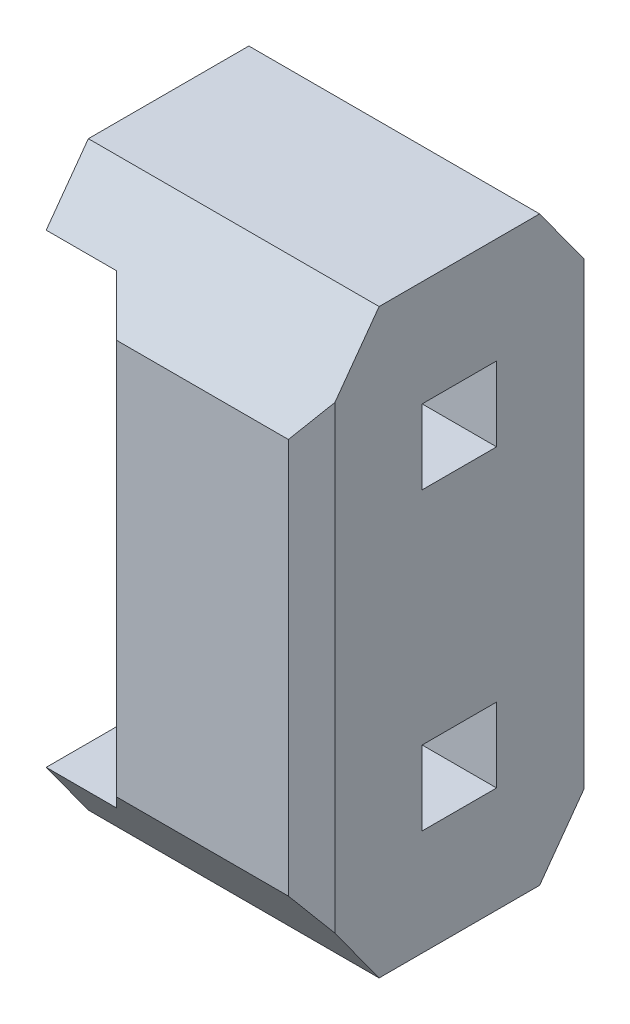
ISO-10303-21;
HEADER;
FILE_DESCRIPTION(('STEP AP214'),'2;1');
FILE_NAME('part.step','',(''),(''),'','','');
FILE_SCHEMA(('AUTOMOTIVE_DESIGN { 1 0 10303 214 1 1 1 1 }'));
ENDSEC;
DATA;
#1=APPLICATION_CONTEXT('core data for automotive mechanical design processes');
#2=APPLICATION_PROTOCOL_DEFINITION('international standard','automotive_design',2000,#1);
#3=PRODUCT_CONTEXT('',#1,'mechanical');
#4=PRODUCT('Part','Part','',(#3));
#5=PRODUCT_RELATED_PRODUCT_CATEGORY('part','',(#4));
#6=PRODUCT_DEFINITION_FORMATION('','',#4);
#7=PRODUCT_DEFINITION_CONTEXT('part definition',#1,'design');
#8=PRODUCT_DEFINITION('design','',#6,#7);
#9=PRODUCT_DEFINITION_SHAPE('','',#8);
#10=(LENGTH_UNIT() NAMED_UNIT(*) SI_UNIT(.MILLI.,.METRE.));
#11=(NAMED_UNIT(*) PLANE_ANGLE_UNIT() SI_UNIT($,.RADIAN.));
#12=(NAMED_UNIT(*) SI_UNIT($,.STERADIAN.) SOLID_ANGLE_UNIT());
#13=UNCERTAINTY_MEASURE_WITH_UNIT(LENGTH_MEASURE(1.E-05),#10,'distance_accuracy_value','');
#14=(GEOMETRIC_REPRESENTATION_CONTEXT(3) GLOBAL_UNCERTAINTY_ASSIGNED_CONTEXT((#13)) GLOBAL_UNIT_ASSIGNED_CONTEXT((#10,
#11,#12)) REPRESENTATION_CONTEXT('',''));
#15=CARTESIAN_POINT('',(0.,0.,0.));
#16=DIRECTION('',(0.,0.,1.));
#17=DIRECTION('',(1.,0.,0.));
#18=AXIS2_PLACEMENT_3D('',#15,#16,#17);
#19=CARTESIAN_POINT('',(1.25,4.6,-18.07));
#20=DIRECTION('',(0.,0.586967571460905,0.809610443394407));
#21=DIRECTION('',(0.,-0.809610443394407,0.586967571460905));
#22=AXIS2_PLACEMENT_3D('',#19,#20,#21);
#23=PLANE('',#22);
#24=DIRECTION('',(1.,0.,0.));
#25=VECTOR('',#24,1.);
#26=CARTESIAN_POINT('',(1.25,4.5,-17.9975));
#27=LINE('',#26,#25);
#28=CARTESIAN_POINT('',(0.,4.5,-17.9975));
#29=VERTEX_POINT('',#28);
#30=CARTESIAN_POINT('',(0.602500000000325,4.5,-17.9975000000001));
#31=VERTEX_POINT('',#30);
#32=EDGE_CURVE('E199',#29,#31,#27,.T.);
#33=ORIENTED_EDGE('',*,*,#32,.T.);
#34=DIRECTION('',(0.506207656348698,-0.698217457033983,0.506207656349602));
#35=VECTOR('',#34,1.);
#36=CARTESIAN_POINT('',(0.6025000000002,4.5,-17.9975));
#37=LINE('',#36,#35);
#38=CARTESIAN_POINT('',(0.819999999999671,4.2,-17.7799999999999));
#39=VERTEX_POINT('',#38);
#40=EDGE_CURVE('E197',#31,#39,#37,.T.);
#41=ORIENTED_EDGE('',*,*,#40,.T.);
#42=DIRECTION('',(1.,0.,0.));
#43=VECTOR('',#42,1.);
#44=CARTESIAN_POINT('',(1.25,4.19999999999999,-17.78));
#45=LINE('',#44,#43);
#46=CARTESIAN_POINT('',(2.30000000000012,4.2,-17.7799999999999));
#47=VERTEX_POINT('',#46);
#48=EDGE_CURVE('E20',#39,#47,#45,.T.);
#49=ORIENTED_EDGE('',*,*,#48,.T.);
#50=DIRECTION('',(0.506207656348961,0.698217457033859,-0.50620765634951));
#51=VECTOR('',#50,1.);
#52=CARTESIAN_POINT('',(2.3,4.19999999999999,-17.78));
#53=LINE('',#52,#51);
#54=CARTESIAN_POINT('',(2.49999999999988,4.47586206896591,-17.9800000000002));
#55=VERTEX_POINT('',#54);
#56=EDGE_CURVE('E181',#47,#55,#53,.T.);
#57=ORIENTED_EDGE('',*,*,#56,.T.);
#58=DIRECTION('',(0.,-0.809610443394407,0.586967571460905));
#59=VECTOR('',#58,1.);
#60=CARTESIAN_POINT('',(2.5,4.6,-18.07));
#61=LINE('',#60,#59);
#62=CARTESIAN_POINT('',(2.5,5.00000000000001,-18.36));
#63=VERTEX_POINT('',#62);
#64=EDGE_CURVE('E188',#55,#63,#61,.F.);
#65=ORIENTED_EDGE('',*,*,#64,.T.);
#66=DIRECTION('',(1.,0.,0.));
#67=VECTOR('',#66,1.);
#68=CARTESIAN_POINT('',(1.25,5.,-18.36));
#69=LINE('',#68,#67);
#70=CARTESIAN_POINT('',(0.,5.00000000000001,-18.36));
#71=VERTEX_POINT('',#70);
#72=EDGE_CURVE('E215',#71,#63,#69,.T.);
#73=ORIENTED_EDGE('',*,*,#72,.F.);
#74=DIRECTION('',(0.,-0.809610443394407,0.586967571460905));
#75=VECTOR('',#74,1.);
#76=CARTESIAN_POINT('',(0.,4.6,-18.07));
#77=LINE('',#76,#75);
#78=EDGE_CURVE('E207',#71,#29,#77,.T.);
#79=ORIENTED_EDGE('',*,*,#78,.T.);
#80=EDGE_LOOP('',(#33,#41,#49,#57,#65,#73,#79));
#81=FACE_BOUND('',#80,.T.);
#82=ADVANCED_FACE('F17',(#81),#23,.T.);
#83=CARTESIAN_POINT('',(1.25,4.6,-20.03));
#84=DIRECTION('',(0.,-0.586967571460905,0.809610443394407));
#85=DIRECTION('',(0.,-0.809610443394407,-0.586967571460905));
#86=AXIS2_PLACEMENT_3D('',#83,#84,#85);
#87=PLANE('',#86);
#88=DIRECTION('',(0.,-0.809610443394407,-0.586967571460905));
#89=VECTOR('',#88,1.);
#90=CARTESIAN_POINT('',(0.,4.6,-20.03));
#91=LINE('',#90,#89);
#92=CARTESIAN_POINT('',(0.,5.00000000000001,-19.74));
#93=VERTEX_POINT('',#92);
#94=CARTESIAN_POINT('',(0.,4.5,-20.1025));
#95=VERTEX_POINT('',#94);
#96=EDGE_CURVE('E263',#93,#95,#91,.T.);
#97=ORIENTED_EDGE('',*,*,#96,.F.);
#98=DIRECTION('',(1.,0.,0.));
#99=VECTOR('',#98,1.);
#100=CARTESIAN_POINT('',(1.25,5.,-19.74));
#101=LINE('',#100,#99);
#102=CARTESIAN_POINT('',(2.5,5.,-19.74));
#103=VERTEX_POINT('',#102);
#104=EDGE_CURVE('E227',#103,#93,#101,.F.);
#105=ORIENTED_EDGE('',*,*,#104,.F.);
#106=DIRECTION('',(0.,-0.809610443394407,-0.586967571460905));
#107=VECTOR('',#106,1.);
#108=CARTESIAN_POINT('',(2.5,4.6,-20.03));
#109=LINE('',#108,#107);
#110=CARTESIAN_POINT('',(2.49999999999988,4.47586206896591,-20.1199999999998));
#111=VERTEX_POINT('',#110);
#112=EDGE_CURVE('E223',#111,#103,#109,.F.);
#113=ORIENTED_EDGE('',*,*,#112,.F.);
#114=DIRECTION('',(0.506207656348961,0.698217457033859,0.50620765634951));
#115=VECTOR('',#114,1.);
#116=CARTESIAN_POINT('',(2.3,4.19999999999999,-20.32));
#117=LINE('',#116,#115);
#118=CARTESIAN_POINT('',(2.30000000000012,4.2,-20.3200000000001));
#119=VERTEX_POINT('',#118);
#120=EDGE_CURVE('E266',#119,#111,#117,.T.);
#121=ORIENTED_EDGE('',*,*,#120,.F.);
#122=DIRECTION('',(1.,0.,0.));
#123=VECTOR('',#122,1.);
#124=CARTESIAN_POINT('',(1.25,4.19999999999999,-20.32));
#125=LINE('',#124,#123);
#126=CARTESIAN_POINT('',(0.819999999999671,4.2,-20.3200000000001));
#127=VERTEX_POINT('',#126);
#128=EDGE_CURVE('E205',#127,#119,#125,.T.);
#129=ORIENTED_EDGE('',*,*,#128,.F.);
#130=DIRECTION('',(0.506207656348697,-0.698217457033984,-0.506207656349602));
#131=VECTOR('',#130,1.);
#132=CARTESIAN_POINT('',(0.6025000000002,4.5,-20.1025));
#133=LINE('',#132,#131);
#134=CARTESIAN_POINT('',(0.602500000000324,4.5,-20.1024999999999));
#135=VERTEX_POINT('',#134);
#136=EDGE_CURVE('E203',#135,#127,#133,.T.);
#137=ORIENTED_EDGE('',*,*,#136,.F.);
#138=DIRECTION('',(1.,0.,0.));
#139=VECTOR('',#138,1.);
#140=CARTESIAN_POINT('',(1.25,4.5,-20.1025));
#141=LINE('',#140,#139);
#142=EDGE_CURVE('E261',#95,#135,#141,.T.);
#143=ORIENTED_EDGE('',*,*,#142,.F.);
#144=EDGE_LOOP('',(#97,#105,#113,#121,#129,#137,#143));
#145=FACE_BOUND('',#144,.T.);
#146=ADVANCED_FACE('F285',(#145),#87,.F.);
#147=CARTESIAN_POINT('',(1.25,0.4,-20.03));
#148=DIRECTION('',(0.,0.586967571460905,0.809610443394407));
#149=DIRECTION('',(0.,-0.809610443394407,0.586967571460905));
#150=AXIS2_PLACEMENT_3D('',#147,#148,#149);
#151=PLANE('',#150);
#152=DIRECTION('',(-0.506207656349401,0.698217457033646,-0.506207656349363));
#153=VECTOR('',#152,1.);
#154=CARTESIAN_POINT('',(2.5,0.524137931034496,-20.12));
#155=LINE('',#154,#153);
#156=CARTESIAN_POINT('',(2.49999999999988,0.524137931034498,-20.1199999999999));
#157=VERTEX_POINT('',#156);
#158=CARTESIAN_POINT('',(2.30000000000012,0.800000000000005,-20.3200000000001));
#159=VERTEX_POINT('',#158);
#160=EDGE_CURVE('E251',#157,#159,#155,.T.);
#161=ORIENTED_EDGE('',*,*,#160,.F.);
#162=DIRECTION('',(0.,-0.809610443394407,0.586967571460905));
#163=VECTOR('',#162,1.);
#164=CARTESIAN_POINT('',(2.5,0.4,-20.03));
#165=LINE('',#164,#163);
#166=CARTESIAN_POINT('',(2.5,0.,-19.74));
#167=VERTEX_POINT('',#166);
#168=EDGE_CURVE('E253',#167,#157,#165,.F.);
#169=ORIENTED_EDGE('',*,*,#168,.F.);
#170=DIRECTION('',(1.,0.,0.));
#171=VECTOR('',#170,1.);
#172=CARTESIAN_POINT('',(1.25,0.,-19.74));
#173=LINE('',#172,#171);
#174=CARTESIAN_POINT('',(0.,0.,-19.74));
#175=VERTEX_POINT('',#174);
#176=EDGE_CURVE('E288',#167,#175,#173,.F.);
#177=ORIENTED_EDGE('',*,*,#176,.T.);
#178=DIRECTION('',(0.,-0.809610443394407,0.586967571460905));
#179=VECTOR('',#178,1.);
#180=CARTESIAN_POINT('',(0.,0.4,-20.03));
#181=LINE('',#180,#179);
#182=CARTESIAN_POINT('',(0.,0.5,-20.1025));
#183=VERTEX_POINT('',#182);
#184=EDGE_CURVE('E255',#183,#175,#181,.T.);
#185=ORIENTED_EDGE('',*,*,#184,.F.);
#186=DIRECTION('',(1.,0.,0.));
#187=VECTOR('',#186,1.);
#188=CARTESIAN_POINT('',(1.25,0.500000000000001,-20.1025));
#189=LINE('',#188,#187);
#190=CARTESIAN_POINT('',(0.602500000000324,0.5,-20.1024999999999));
#191=VERTEX_POINT('',#190);
#192=EDGE_CURVE('E257',#191,#183,#189,.F.);
#193=ORIENTED_EDGE('',*,*,#192,.F.);
#194=DIRECTION('',(-0.506207656348693,-0.698217457033984,0.506207656349605));
#195=VECTOR('',#194,1.);
#196=CARTESIAN_POINT('',(0.8199999999998,0.80000000000001,-20.32));
#197=LINE('',#196,#195);
#198=CARTESIAN_POINT('',(0.819999999999671,0.800000000000005,-20.3200000000001));
#199=VERTEX_POINT('',#198);
#200=EDGE_CURVE('E259',#199,#191,#197,.T.);
#201=ORIENTED_EDGE('',*,*,#200,.F.);
#202=DIRECTION('',(1.,0.,0.));
#203=VECTOR('',#202,1.);
#204=CARTESIAN_POINT('',(1.25,0.80000000000001,-20.32));
#205=LINE('',#204,#203);
#206=EDGE_CURVE('E249',#159,#199,#205,.F.);
#207=ORIENTED_EDGE('',*,*,#206,.F.);
#208=EDGE_LOOP('',(#161,#169,#177,#185,#193,#201,#207));
#209=FACE_BOUND('',#208,.T.);
#210=ADVANCED_FACE('F431',(#209),#151,.F.);
#211=CARTESIAN_POINT('',(1.25,0.4,-18.07));
#212=DIRECTION('',(0.,-0.586967571460905,0.809610443394407));
#213=DIRECTION('',(0.,-0.809610443394407,-0.586967571460905));
#214=AXIS2_PLACEMENT_3D('',#211,#212,#213);
#215=PLANE('',#214);
#216=DIRECTION('',(1.,0.,0.));
#217=VECTOR('',#216,1.);
#218=CARTESIAN_POINT('',(1.25,0.80000000000001,-17.78));
#219=LINE('',#218,#217);
#220=CARTESIAN_POINT('',(2.30000000000012,0.800000000000005,-17.7799999999999));
#221=VERTEX_POINT('',#220);
#222=CARTESIAN_POINT('',(0.819999999999671,0.800000000000005,-17.7799999999999));
#223=VERTEX_POINT('',#222);
#224=EDGE_CURVE('E191',#221,#223,#219,.F.);
#225=ORIENTED_EDGE('',*,*,#224,.T.);
#226=DIRECTION('',(-0.506207656348694,-0.698217457033983,-0.506207656349606));
#227=VECTOR('',#226,1.);
#228=CARTESIAN_POINT('',(0.8199999999998,0.80000000000001,-17.78));
#229=LINE('',#228,#227);
#230=CARTESIAN_POINT('',(0.602500000000325,0.500000000000001,-17.9975000000001));
#231=VERTEX_POINT('',#230);
#232=EDGE_CURVE('E232',#223,#231,#229,.T.);
#233=ORIENTED_EDGE('',*,*,#232,.T.);
#234=DIRECTION('',(1.,0.,0.));
#235=VECTOR('',#234,1.);
#236=CARTESIAN_POINT('',(1.25,0.500000000000002,-17.9975));
#237=LINE('',#236,#235);
#238=CARTESIAN_POINT('',(0.,0.500000000000001,-17.9975));
#239=VERTEX_POINT('',#238);
#240=EDGE_CURVE('E246',#231,#239,#237,.F.);
#241=ORIENTED_EDGE('',*,*,#240,.T.);
#242=DIRECTION('',(0.,-0.809610443394407,-0.586967571460905));
#243=VECTOR('',#242,1.);
#244=CARTESIAN_POINT('',(0.,0.4,-18.07));
#245=LINE('',#244,#243);
#246=CARTESIAN_POINT('',(0.,0.,-18.36));
#247=VERTEX_POINT('',#246);
#248=EDGE_CURVE('E244',#239,#247,#245,.T.);
#249=ORIENTED_EDGE('',*,*,#248,.T.);
#250=DIRECTION('',(1.,0.,0.));
#251=VECTOR('',#250,1.);
#252=CARTESIAN_POINT('',(1.25,0.,-18.36));
#253=LINE('',#252,#251);
#254=CARTESIAN_POINT('',(2.5,0.,-18.36));
#255=VERTEX_POINT('',#254);
#256=EDGE_CURVE('E293',#247,#255,#253,.T.);
#257=ORIENTED_EDGE('',*,*,#256,.T.);
#258=DIRECTION('',(0.,-0.809610443394407,-0.586967571460905));
#259=VECTOR('',#258,1.);
#260=CARTESIAN_POINT('',(2.5,0.4,-18.07));
#261=LINE('',#260,#259);
#262=CARTESIAN_POINT('',(2.49999999999988,0.524137931034498,-17.9800000000001));
#263=VERTEX_POINT('',#262);
#264=EDGE_CURVE('E241',#255,#263,#261,.F.);
#265=ORIENTED_EDGE('',*,*,#264,.T.);
#266=DIRECTION('',(-0.506207656349401,0.698217457033646,0.506207656349363));
#267=VECTOR('',#266,1.);
#268=CARTESIAN_POINT('',(2.5,0.524137931034496,-17.98));
#269=LINE('',#268,#267);
#270=EDGE_CURVE('E239',#263,#221,#269,.T.);
#271=ORIENTED_EDGE('',*,*,#270,.T.);
#272=EDGE_LOOP('',(#225,#233,#241,#249,#257,#265,#271));
#273=FACE_BOUND('',#272,.T.);
#274=ADVANCED_FACE('F421',(#273),#215,.T.);
#275=CARTESIAN_POINT('',(1.25,5.,-19.05));
#276=DIRECTION('',(0.,1.,0.));
#277=DIRECTION('',(0.,0.,1.));
#278=AXIS2_PLACEMENT_3D('',#275,#276,#277);
#279=PLANE('',#278);
#280=ORIENTED_EDGE('',*,*,#104,.T.);
#281=DIRECTION('',(0.,0.,-1.));
#282=VECTOR('',#281,1.);
#283=CARTESIAN_POINT('',(0.,5.,-19.05));
#284=LINE('',#283,#282);
#285=EDGE_CURVE('E231',#93,#71,#284,.F.);
#286=ORIENTED_EDGE('',*,*,#285,.T.);
#287=ORIENTED_EDGE('',*,*,#72,.T.);
#288=DIRECTION('',(0.,0.,1.));
#289=VECTOR('',#288,1.);
#290=CARTESIAN_POINT('',(2.5,5.,-19.05));
#291=LINE('',#290,#289);
#292=EDGE_CURVE('E219',#63,#103,#291,.F.);
#293=ORIENTED_EDGE('',*,*,#292,.T.);
#294=EDGE_LOOP('',(#280,#286,#287,#293));
#295=FACE_BOUND('',#294,.T.);
#296=ADVANCED_FACE('F229',(#295),#279,.T.);
#297=CARTESIAN_POINT('',(1.25,0.,-19.05));
#298=DIRECTION('',(0.,1.,0.));
#299=DIRECTION('',(0.,0.,1.));
#300=AXIS2_PLACEMENT_3D('',#297,#298,#299);
#301=PLANE('',#300);
#302=DIRECTION('',(0.,0.,-1.));
#303=VECTOR('',#302,1.);
#304=CARTESIAN_POINT('',(0.,0.,-19.05));
#305=LINE('',#304,#303);
#306=EDGE_CURVE('E297',#247,#175,#305,.T.);
#307=ORIENTED_EDGE('',*,*,#306,.T.);
#308=ORIENTED_EDGE('',*,*,#176,.F.);
#309=DIRECTION('',(0.,0.,1.));
#310=VECTOR('',#309,1.);
#311=CARTESIAN_POINT('',(2.5,0.,-19.05));
#312=LINE('',#311,#310);
#313=EDGE_CURVE('E287',#255,#167,#312,.F.);
#314=ORIENTED_EDGE('',*,*,#313,.F.);
#315=ORIENTED_EDGE('',*,*,#256,.F.);
#316=EDGE_LOOP('',(#307,#308,#314,#315));
#317=FACE_BOUND('',#316,.T.);
#318=ADVANCED_FACE('F428',(#317),#301,.F.);
#319=CARTESIAN_POINT('',(0.,4.75,-19.05));
#320=DIRECTION('',(1.,0.,0.));
#321=DIRECTION('',(0.,0.,-1.));
#322=AXIS2_PLACEMENT_3D('',#319,#320,#321);
#323=PLANE('',#322);
#324=ORIENTED_EDGE('',*,*,#285,.F.);
#325=ORIENTED_EDGE('',*,*,#96,.T.);
#326=DIRECTION('',(0.,0.,1.));
#327=VECTOR('',#326,1.);
#328=CARTESIAN_POINT('',(0.,4.5,-19.05));
#329=LINE('',#328,#327);
#330=EDGE_CURVE('E307',#95,#29,#329,.T.);
#331=ORIENTED_EDGE('',*,*,#330,.T.);
#332=ORIENTED_EDGE('',*,*,#78,.F.);
#333=EDGE_LOOP('',(#324,#325,#331,#332));
#334=FACE_BOUND('',#333,.T.);
#335=ADVANCED_FACE('F441',(#334),#323,.F.);
#336=CARTESIAN_POINT('',(0.,0.25,-19.05));
#337=DIRECTION('',(1.,0.,0.));
#338=DIRECTION('',(0.,0.,-1.));
#339=AXIS2_PLACEMENT_3D('',#336,#337,#338);
#340=PLANE('',#339);
#341=ORIENTED_EDGE('',*,*,#306,.F.);
#342=ORIENTED_EDGE('',*,*,#248,.F.);
#343=DIRECTION('',(0.,0.,1.));
#344=VECTOR('',#343,1.);
#345=CARTESIAN_POINT('',(0.,0.5,-19.05));
#346=LINE('',#345,#344);
#347=EDGE_CURVE('E315',#183,#239,#346,.T.);
#348=ORIENTED_EDGE('',*,*,#347,.F.);
#349=ORIENTED_EDGE('',*,*,#184,.T.);
#350=EDGE_LOOP('',(#341,#342,#348,#349));
#351=FACE_BOUND('',#350,.T.);
#352=ADVANCED_FACE('F443',(#351),#340,.F.);
#353=CARTESIAN_POINT('',(1.55,3.45,-19.05));
#354=DIRECTION('',(0.,1.,0.));
#355=DIRECTION('',(0.,0.,1.));
#356=AXIS2_PLACEMENT_3D('',#353,#354,#355);
#357=PLANE('',#356);
#358=DIRECTION('',(1.,0.,0.));
#359=VECTOR('',#358,1.);
#360=CARTESIAN_POINT('',(1.55,3.45,-19.37));
#361=LINE('',#360,#359);
#362=CARTESIAN_POINT('',(0.6,3.45,-19.37));
#363=VERTEX_POINT('',#362);
#364=CARTESIAN_POINT('',(2.5,3.45,-19.37));
#365=VERTEX_POINT('',#364);
#366=EDGE_CURVE('E332',#363,#365,#361,.T.);
#367=ORIENTED_EDGE('',*,*,#366,.F.);
#368=DIRECTION('',(0.,0.,1.));
#369=VECTOR('',#368,1.);
#370=CARTESIAN_POINT('',(0.6,3.45,-19.05));
#371=LINE('',#370,#369);
#372=CARTESIAN_POINT('',(0.6,3.45,-18.73));
#373=VERTEX_POINT('',#372);
#374=EDGE_CURVE('E302',#363,#373,#371,.T.);
#375=ORIENTED_EDGE('',*,*,#374,.T.);
#376=DIRECTION('',(1.,0.,0.));
#377=VECTOR('',#376,1.);
#378=CARTESIAN_POINT('',(1.55,3.45,-18.73));
#379=LINE('',#378,#377);
#380=CARTESIAN_POINT('',(2.5,3.45,-18.73));
#381=VERTEX_POINT('',#380);
#382=EDGE_CURVE('E327',#373,#381,#379,.T.);
#383=ORIENTED_EDGE('',*,*,#382,.T.);
#384=DIRECTION('',(0.,0.,1.));
#385=VECTOR('',#384,1.);
#386=CARTESIAN_POINT('',(2.5,3.45,-19.05));
#387=LINE('',#386,#385);
#388=EDGE_CURVE('E300',#381,#365,#387,.F.);
#389=ORIENTED_EDGE('',*,*,#388,.T.);
#390=EDGE_LOOP('',(#367,#375,#383,#389));
#391=FACE_BOUND('',#390,.T.);
#392=ADVANCED_FACE('F398',(#391),#357,.T.);
#393=CARTESIAN_POINT('',(0.71,2.5,-20.21));
#394=DIRECTION('',(0.707106781190498,0.,0.707106781182598));
#395=DIRECTION('',(0.707106781182598,0.,-0.707106781190498));
#396=AXIS2_PLACEMENT_3D('',#393,#394,#395);
#397=PLANE('',#396);
#398=ORIENTED_EDGE('',*,*,#200,.T.);
#399=DIRECTION('',(0.707106781187161,0.,-0.707106781185934));
#400=VECTOR('',#399,1.);
#401=CARTESIAN_POINT('',(0.6000000000002,0.5,-20.1));
#402=LINE('',#401,#400);
#403=CARTESIAN_POINT('',(0.600000000000408,0.5,-20.0999999999997));
#404=VERTEX_POINT('',#403);
#405=EDGE_CURVE('E312',#404,#191,#402,.T.);
#406=ORIENTED_EDGE('',*,*,#405,.F.);
#407=DIRECTION('',(0.,1.,0.));
#408=VECTOR('',#407,1.);
#409=CARTESIAN_POINT('',(0.6,2.5,-20.1));
#410=LINE('',#409,#408);
#411=CARTESIAN_POINT('',(0.600000000000408,4.5,-20.0999999999997));
#412=VERTEX_POINT('',#411);
#413=EDGE_CURVE('E337',#404,#412,#410,.T.);
#414=ORIENTED_EDGE('',*,*,#413,.T.);
#415=DIRECTION('',(0.707106781187161,0.,-0.707106781185934));
#416=VECTOR('',#415,1.);
#417=CARTESIAN_POINT('',(0.6000000000002,4.5,-20.1));
#418=LINE('',#417,#416);
#419=EDGE_CURVE('E304',#412,#135,#418,.T.);
#420=ORIENTED_EDGE('',*,*,#419,.T.);
#421=ORIENTED_EDGE('',*,*,#136,.T.);
#422=DIRECTION('',(0.,1.,0.));
#423=VECTOR('',#422,1.);
#424=CARTESIAN_POINT('',(0.8199999999998,2.5,-20.32));
#425=LINE('',#424,#423);
#426=EDGE_CURVE('E275',#127,#199,#425,.F.);
#427=ORIENTED_EDGE('',*,*,#426,.T.);
#428=EDGE_LOOP('',(#398,#406,#414,#420,#421,#427));
#429=FACE_BOUND('',#428,.T.);
#430=ADVANCED_FACE('F435',(#429),#397,.F.);
#431=CARTESIAN_POINT('',(0.30125,4.5,-19.05));
#432=DIRECTION('',(0.,1.,0.));
#433=DIRECTION('',(0.,0.,1.));
#434=AXIS2_PLACEMENT_3D('',#431,#432,#433);
#435=PLANE('',#434);
#436=ORIENTED_EDGE('',*,*,#142,.T.);
#437=ORIENTED_EDGE('',*,*,#419,.F.);
#438=DIRECTION('',(0.,0.,-1.));
#439=VECTOR('',#438,1.);
#440=CARTESIAN_POINT('',(0.6,4.5,-19.05));
#441=LINE('',#440,#439);
#442=CARTESIAN_POINT('',(0.600000000000278,4.5,-18.0000000000001));
#443=VERTEX_POINT('',#442);
#444=EDGE_CURVE('E339',#412,#443,#441,.F.);
#445=ORIENTED_EDGE('',*,*,#444,.T.);
#446=DIRECTION('',(-0.707106781182598,0.,-0.707106781190498));
#447=VECTOR('',#446,1.);
#448=CARTESIAN_POINT('',(0.71,4.5,-17.89));
#449=LINE('',#448,#447);
#450=EDGE_CURVE('E310',#443,#31,#449,.F.);
#451=ORIENTED_EDGE('',*,*,#450,.T.);
#452=ORIENTED_EDGE('',*,*,#32,.F.);
#453=ORIENTED_EDGE('',*,*,#330,.F.);
#454=EDGE_LOOP('',(#436,#437,#445,#451,#452,#453));
#455=FACE_BOUND('',#454,.T.);
#456=ADVANCED_FACE('F439',(#455),#435,.F.);
#457=CARTESIAN_POINT('',(0.71,2.5,-17.89));
#458=DIRECTION('',(0.707106781190498,0.,-0.707106781182598));
#459=DIRECTION('',(-0.707106781182598,0.,-0.707106781190498));
#460=AXIS2_PLACEMENT_3D('',#457,#458,#459);
#461=PLANE('',#460);
#462=ORIENTED_EDGE('',*,*,#232,.F.);
#463=DIRECTION('',(0.,1.,0.));
#464=VECTOR('',#463,1.);
#465=CARTESIAN_POINT('',(0.8199999999998,2.5,-17.78));
#466=LINE('',#465,#464);
#467=EDGE_CURVE('E325',#39,#223,#466,.F.);
#468=ORIENTED_EDGE('',*,*,#467,.F.);
#469=ORIENTED_EDGE('',*,*,#40,.F.);
#470=ORIENTED_EDGE('',*,*,#450,.F.);
#471=DIRECTION('',(0.,1.,0.));
#472=VECTOR('',#471,1.);
#473=CARTESIAN_POINT('',(0.6,2.5,-18.));
#474=LINE('',#473,#472);
#475=CARTESIAN_POINT('',(0.600000000000407,0.5,-18.0000000000003));
#476=VERTEX_POINT('',#475);
#477=EDGE_CURVE('E341',#443,#476,#474,.F.);
#478=ORIENTED_EDGE('',*,*,#477,.T.);
#479=DIRECTION('',(-0.70710678118618,0.,-0.707106781186916));
#480=VECTOR('',#479,1.);
#481=CARTESIAN_POINT('',(0.6025000000002,0.5,-17.9975));
#482=LINE('',#481,#480);
#483=EDGE_CURVE('E318',#231,#476,#482,.T.);
#484=ORIENTED_EDGE('',*,*,#483,.F.);
#485=EDGE_LOOP('',(#462,#468,#469,#470,#478,#484));
#486=FACE_BOUND('',#485,.T.);
#487=ADVANCED_FACE('F416',(#486),#461,.F.);
#488=CARTESIAN_POINT('',(0.30125,0.5,-19.05));
#489=DIRECTION('',(0.,1.,0.));
#490=DIRECTION('',(0.,0.,1.));
#491=AXIS2_PLACEMENT_3D('',#488,#489,#490);
#492=PLANE('',#491);
#493=ORIENTED_EDGE('',*,*,#483,.T.);
#494=DIRECTION('',(0.,0.,-1.));
#495=VECTOR('',#494,1.);
#496=CARTESIAN_POINT('',(0.6,0.5,-19.05));
#497=LINE('',#496,#495);
#498=EDGE_CURVE('E343',#476,#404,#497,.T.);
#499=ORIENTED_EDGE('',*,*,#498,.T.);
#500=ORIENTED_EDGE('',*,*,#405,.T.);
#501=ORIENTED_EDGE('',*,*,#192,.T.);
#502=ORIENTED_EDGE('',*,*,#347,.T.);
#503=ORIENTED_EDGE('',*,*,#240,.F.);
#504=EDGE_LOOP('',(#493,#499,#500,#501,#502,#503));
#505=FACE_BOUND('',#504,.T.);
#506=ADVANCED_FACE('F418',(#505),#492,.T.);
#507=CARTESIAN_POINT('',(1.55,1.23,-19.37));
#508=DIRECTION('',(0.,0.,1.));
#509=DIRECTION('',(1.,0.,0.));
#510=AXIS2_PLACEMENT_3D('',#507,#508,#509);
#511=PLANE('',#510);
#512=DIRECTION('',(1.,0.,0.));
#513=VECTOR('',#512,1.);
#514=CARTESIAN_POINT('',(1.55,1.55,-19.37));
#515=LINE('',#514,#513);
#516=CARTESIAN_POINT('',(2.5,1.55,-19.37));
#517=VERTEX_POINT('',#516);
#518=CARTESIAN_POINT('',(0.6,1.55,-19.37));
#519=VERTEX_POINT('',#518);
#520=EDGE_CURVE('E283',#517,#519,#515,.F.);
#521=ORIENTED_EDGE('',*,*,#520,.T.);
#522=DIRECTION('',(0.,1.,0.));
#523=VECTOR('',#522,1.);
#524=CARTESIAN_POINT('',(0.6,2.5,-19.37));
#525=LINE('',#524,#523);
#526=CARTESIAN_POINT('',(0.6,0.91,-19.37));
#527=VERTEX_POINT('',#526);
#528=EDGE_CURVE('E346',#519,#527,#525,.F.);
#529=ORIENTED_EDGE('',*,*,#528,.T.);
#530=DIRECTION('',(1.,0.,0.));
#531=VECTOR('',#530,1.);
#532=CARTESIAN_POINT('',(1.55,0.91,-19.37));
#533=LINE('',#532,#531);
#534=CARTESIAN_POINT('',(2.5,0.91,-19.37));
#535=VERTEX_POINT('',#534);
#536=EDGE_CURVE('E354',#535,#527,#533,.F.);
#537=ORIENTED_EDGE('',*,*,#536,.F.);
#538=DIRECTION('',(0.,1.,0.));
#539=VECTOR('',#538,1.);
#540=CARTESIAN_POINT('',(2.5,1.23,-19.37));
#541=LINE('',#540,#539);
#542=EDGE_CURVE('E321',#535,#517,#541,.T.);
#543=ORIENTED_EDGE('',*,*,#542,.T.);
#544=EDGE_LOOP('',(#521,#529,#537,#543));
#545=FACE_BOUND('',#544,.T.);
#546=ADVANCED_FACE('F483',(#545),#511,.T.);
#547=CARTESIAN_POINT('',(1.56,2.5,-20.32));
#548=DIRECTION('',(0.,0.,1.));
#549=DIRECTION('',(1.,0.,0.));
#550=AXIS2_PLACEMENT_3D('',#547,#548,#549);
#551=PLANE('',#550);
#552=DIRECTION('',(0.,1.,0.));
#553=VECTOR('',#552,1.);
#554=CARTESIAN_POINT('',(2.30000000000047,2.5,-20.3200000000005));
#555=LINE('',#554,#553);
#556=EDGE_CURVE('E193',#159,#119,#555,.T.);
#557=ORIENTED_EDGE('',*,*,#556,.F.);
#558=ORIENTED_EDGE('',*,*,#206,.T.);
#559=ORIENTED_EDGE('',*,*,#426,.F.);
#560=ORIENTED_EDGE('',*,*,#128,.T.);
#561=EDGE_LOOP('',(#557,#558,#559,#560));
#562=FACE_BOUND('',#561,.T.);
#563=ADVANCED_FACE('F272',(#562),#551,.F.);
#564=CARTESIAN_POINT('',(1.56,2.5,-17.78));
#565=DIRECTION('',(0.,0.,1.));
#566=DIRECTION('',(1.,0.,0.));
#567=AXIS2_PLACEMENT_3D('',#564,#565,#566);
#568=PLANE('',#567);
#569=ORIENTED_EDGE('',*,*,#48,.F.);
#570=ORIENTED_EDGE('',*,*,#467,.T.);
#571=ORIENTED_EDGE('',*,*,#224,.F.);
#572=DIRECTION('',(0.,1.,0.));
#573=VECTOR('',#572,1.);
#574=CARTESIAN_POINT('',(2.30000000000047,2.5,-17.7799999999995));
#575=LINE('',#574,#573);
#576=EDGE_CURVE('E183',#47,#221,#575,.F.);
#577=ORIENTED_EDGE('',*,*,#576,.F.);
#578=EDGE_LOOP('',(#569,#570,#571,#577));
#579=FACE_BOUND('',#578,.T.);
#580=ADVANCED_FACE('F189',(#579),#568,.T.);
#581=CARTESIAN_POINT('',(1.55,3.77,-18.73));
#582=DIRECTION('',(0.,0.,1.));
#583=DIRECTION('',(1.,0.,0.));
#584=AXIS2_PLACEMENT_3D('',#581,#582,#583);
#585=PLANE('',#584);
#586=DIRECTION('',(0.,1.,0.));
#587=VECTOR('',#586,1.);
#588=CARTESIAN_POINT('',(2.5,3.77,-18.73));
#589=LINE('',#588,#587);
#590=CARTESIAN_POINT('',(2.5,4.09,-18.73));
#591=VERTEX_POINT('',#590);
#592=EDGE_CURVE('E330',#381,#591,#589,.T.);
#593=ORIENTED_EDGE('',*,*,#592,.F.);
#594=ORIENTED_EDGE('',*,*,#382,.F.);
#595=DIRECTION('',(0.,1.,0.));
#596=VECTOR('',#595,1.);
#597=CARTESIAN_POINT('',(0.6,2.5,-18.73));
#598=LINE('',#597,#596);
#599=CARTESIAN_POINT('',(0.6,4.09,-18.73));
#600=VERTEX_POINT('',#599);
#601=EDGE_CURVE('E351',#373,#600,#598,.T.);
#602=ORIENTED_EDGE('',*,*,#601,.T.);
#603=DIRECTION('',(1.,0.,0.));
#604=VECTOR('',#603,1.);
#605=CARTESIAN_POINT('',(1.55,4.09,-18.73));
#606=LINE('',#605,#604);
#607=EDGE_CURVE('E368',#600,#591,#606,.T.);
#608=ORIENTED_EDGE('',*,*,#607,.T.);
#609=EDGE_LOOP('',(#593,#594,#602,#608));
#610=FACE_BOUND('',#609,.T.);
#611=ADVANCED_FACE('F402',(#610),#585,.F.);
#612=CARTESIAN_POINT('',(1.55,3.77,-19.37));
#613=DIRECTION('',(0.,0.,1.));
#614=DIRECTION('',(1.,0.,0.));
#615=AXIS2_PLACEMENT_3D('',#612,#613,#614);
#616=PLANE('',#615);
#617=DIRECTION('',(1.,0.,0.));
#618=VECTOR('',#617,1.);
#619=CARTESIAN_POINT('',(1.55,4.09,-19.37));
#620=LINE('',#619,#618);
#621=CARTESIAN_POINT('',(2.5,4.09,-19.37));
#622=VERTEX_POINT('',#621);
#623=CARTESIAN_POINT('',(0.6,4.09,-19.37));
#624=VERTEX_POINT('',#623);
#625=EDGE_CURVE('E371',#622,#624,#620,.F.);
#626=ORIENTED_EDGE('',*,*,#625,.T.);
#627=DIRECTION('',(0.,1.,0.));
#628=VECTOR('',#627,1.);
#629=CARTESIAN_POINT('',(0.6,2.5,-19.37));
#630=LINE('',#629,#628);
#631=EDGE_CURVE('E348',#624,#363,#630,.F.);
#632=ORIENTED_EDGE('',*,*,#631,.T.);
#633=ORIENTED_EDGE('',*,*,#366,.T.);
#634=DIRECTION('',(0.,1.,0.));
#635=VECTOR('',#634,1.);
#636=CARTESIAN_POINT('',(2.5,3.77,-19.37));
#637=LINE('',#636,#635);
#638=EDGE_CURVE('E335',#365,#622,#637,.T.);
#639=ORIENTED_EDGE('',*,*,#638,.T.);
#640=EDGE_LOOP('',(#626,#632,#633,#639));
#641=FACE_BOUND('',#640,.T.);
#642=ADVANCED_FACE('F395',(#641),#616,.T.);
#643=CARTESIAN_POINT('',(0.6,2.5,-19.05));
#644=DIRECTION('',(1.,0.,0.));
#645=DIRECTION('',(0.,0.,-1.));
#646=AXIS2_PLACEMENT_3D('',#643,#644,#645);
#647=PLANE('',#646);
#648=ORIENTED_EDGE('',*,*,#374,.F.);
#649=ORIENTED_EDGE('',*,*,#631,.F.);
#650=DIRECTION('',(0.,0.,1.));
#651=VECTOR('',#650,1.);
#652=CARTESIAN_POINT('',(0.6,4.09,-19.05));
#653=LINE('',#652,#651);
#654=EDGE_CURVE('E192',#624,#600,#653,.T.);
#655=ORIENTED_EDGE('',*,*,#654,.T.);
#656=ORIENTED_EDGE('',*,*,#601,.F.);
#657=EDGE_LOOP('',(#648,#649,#655,#656));
#658=FACE_BOUND('',#657,.T.);
#659=ORIENTED_EDGE('',*,*,#528,.F.);
#660=DIRECTION('',(0.,0.,1.));
#661=VECTOR('',#660,1.);
#662=CARTESIAN_POINT('',(0.6,1.55,-19.05));
#663=LINE('',#662,#661);
#664=CARTESIAN_POINT('',(0.6,1.55,-18.73));
#665=VERTEX_POINT('',#664);
#666=EDGE_CURVE('E360',#519,#665,#663,.T.);
#667=ORIENTED_EDGE('',*,*,#666,.T.);
#668=DIRECTION('',(0.,1.,0.));
#669=VECTOR('',#668,1.);
#670=CARTESIAN_POINT('',(0.6,1.23,-18.73));
#671=LINE('',#670,#669);
#672=CARTESIAN_POINT('',(0.6,0.91,-18.73));
#673=VERTEX_POINT('',#672);
#674=EDGE_CURVE('E374',#665,#673,#671,.F.);
#675=ORIENTED_EDGE('',*,*,#674,.T.);
#676=DIRECTION('',(0.,0.,1.));
#677=VECTOR('',#676,1.);
#678=CARTESIAN_POINT('',(0.6,0.91,-19.05));
#679=LINE('',#678,#677);
#680=EDGE_CURVE('E357',#527,#673,#679,.T.);
#681=ORIENTED_EDGE('',*,*,#680,.F.);
#682=EDGE_LOOP('',(#659,#667,#675,#681));
#683=FACE_BOUND('',#682,.T.);
#684=ORIENTED_EDGE('',*,*,#477,.F.);
#685=ORIENTED_EDGE('',*,*,#444,.F.);
#686=ORIENTED_EDGE('',*,*,#413,.F.);
#687=ORIENTED_EDGE('',*,*,#498,.F.);
#688=EDGE_LOOP('',(#684,#685,#686,#687));
#689=FACE_BOUND('',#688,.T.);
#690=ADVANCED_FACE('F404',(#658,#683,#689),#647,.F.);
#691=CARTESIAN_POINT('',(1.55,0.91,-19.05));
#692=DIRECTION('',(0.,1.,0.));
#693=DIRECTION('',(0.,0.,1.));
#694=AXIS2_PLACEMENT_3D('',#691,#692,#693);
#695=PLANE('',#694);
#696=ORIENTED_EDGE('',*,*,#536,.T.);
#697=ORIENTED_EDGE('',*,*,#680,.T.);
#698=DIRECTION('',(1.,0.,0.));
#699=VECTOR('',#698,1.);
#700=CARTESIAN_POINT('',(1.55,0.91,-18.73));
#701=LINE('',#700,#699);
#702=CARTESIAN_POINT('',(2.5,0.91,-18.73));
#703=VERTEX_POINT('',#702);
#704=EDGE_CURVE('E376',#673,#703,#701,.T.);
#705=ORIENTED_EDGE('',*,*,#704,.T.);
#706=DIRECTION('',(0.,0.,1.));
#707=VECTOR('',#706,1.);
#708=CARTESIAN_POINT('',(2.5,0.91,-19.05));
#709=LINE('',#708,#707);
#710=EDGE_CURVE('E34',#703,#535,#709,.F.);
#711=ORIENTED_EDGE('',*,*,#710,.T.);
#712=EDGE_LOOP('',(#696,#697,#705,#711));
#713=FACE_BOUND('',#712,.T.);
#714=ADVANCED_FACE('F407',(#713),#695,.T.);
#715=CARTESIAN_POINT('',(1.55,1.55,-19.05));
#716=DIRECTION('',(0.,1.,0.));
#717=DIRECTION('',(0.,0.,1.));
#718=AXIS2_PLACEMENT_3D('',#715,#716,#717);
#719=PLANE('',#718);
#720=DIRECTION('',(0.,0.,1.));
#721=VECTOR('',#720,1.);
#722=CARTESIAN_POINT('',(2.5,1.55,-19.05));
#723=LINE('',#722,#721);
#724=CARTESIAN_POINT('',(2.5,1.55,-18.73));
#725=VERTEX_POINT('',#724);
#726=EDGE_CURVE('E362',#725,#517,#723,.F.);
#727=ORIENTED_EDGE('',*,*,#726,.F.);
#728=DIRECTION('',(1.,0.,0.));
#729=VECTOR('',#728,1.);
#730=CARTESIAN_POINT('',(1.55,1.55,-18.73));
#731=LINE('',#730,#729);
#732=EDGE_CURVE('E378',#725,#665,#731,.F.);
#733=ORIENTED_EDGE('',*,*,#732,.T.);
#734=ORIENTED_EDGE('',*,*,#666,.F.);
#735=ORIENTED_EDGE('',*,*,#520,.F.);
#736=EDGE_LOOP('',(#727,#733,#734,#735));
#737=FACE_BOUND('',#736,.T.);
#738=ADVANCED_FACE('F468',(#737),#719,.F.);
#739=CARTESIAN_POINT('',(2.4,2.5,-20.22));
#740=DIRECTION('',(0.707106781189898,0.,-0.707106781183198));
#741=DIRECTION('',(-0.707106781183198,0.,-0.707106781189898));
#742=AXIS2_PLACEMENT_3D('',#739,#740,#741);
#743=PLANE('',#742);
#744=DIRECTION('',(0.,1.,0.));
#745=VECTOR('',#744,1.);
#746=CARTESIAN_POINT('',(2.5,2.5,-20.12));
#747=LINE('',#746,#745);
#748=EDGE_CURVE('E381',#157,#111,#747,.T.);
#749=ORIENTED_EDGE('',*,*,#748,.F.);
#750=ORIENTED_EDGE('',*,*,#160,.T.);
#751=ORIENTED_EDGE('',*,*,#556,.T.);
#752=ORIENTED_EDGE('',*,*,#120,.T.);
#753=EDGE_LOOP('',(#749,#750,#751,#752));
#754=FACE_BOUND('',#753,.T.);
#755=ADVANCED_FACE('F281',(#754),#743,.T.);
#756=CARTESIAN_POINT('',(2.4,2.5,-17.88));
#757=DIRECTION('',(0.707106781189898,0.,0.707106781183198));
#758=DIRECTION('',(0.707106781183198,0.,-0.707106781189898));
#759=AXIS2_PLACEMENT_3D('',#756,#757,#758);
#760=PLANE('',#759);
#761=DIRECTION('',(0.,1.,0.));
#762=VECTOR('',#761,1.);
#763=CARTESIAN_POINT('',(2.5,2.5,-17.98));
#764=LINE('',#763,#762);
#765=EDGE_CURVE('E186',#55,#263,#764,.F.);
#766=ORIENTED_EDGE('',*,*,#765,.F.);
#767=ORIENTED_EDGE('',*,*,#56,.F.);
#768=ORIENTED_EDGE('',*,*,#576,.T.);
#769=ORIENTED_EDGE('',*,*,#270,.F.);
#770=EDGE_LOOP('',(#766,#767,#768,#769));
#771=FACE_BOUND('',#770,.T.);
#772=ADVANCED_FACE('F182',(#771),#760,.T.);
#773=CARTESIAN_POINT('',(1.55,4.09,-19.05));
#774=DIRECTION('',(0.,1.,0.));
#775=DIRECTION('',(0.,0.,1.));
#776=AXIS2_PLACEMENT_3D('',#773,#774,#775);
#777=PLANE('',#776);
#778=DIRECTION('',(0.,0.,-1.));
#779=VECTOR('',#778,1.);
#780=CARTESIAN_POINT('',(2.5,4.09,-19.05));
#781=LINE('',#780,#779);
#782=EDGE_CURVE('E26',#591,#622,#781,.T.);
#783=ORIENTED_EDGE('',*,*,#782,.F.);
#784=ORIENTED_EDGE('',*,*,#607,.F.);
#785=ORIENTED_EDGE('',*,*,#654,.F.);
#786=ORIENTED_EDGE('',*,*,#625,.F.);
#787=EDGE_LOOP('',(#783,#784,#785,#786));
#788=FACE_BOUND('',#787,.T.);
#789=ADVANCED_FACE('F392',(#788),#777,.F.);
#790=CARTESIAN_POINT('',(1.55,1.23,-18.73));
#791=DIRECTION('',(0.,0.,1.));
#792=DIRECTION('',(1.,0.,0.));
#793=AXIS2_PLACEMENT_3D('',#790,#791,#792);
#794=PLANE('',#793);
#795=DIRECTION('',(0.,1.,0.));
#796=VECTOR('',#795,1.);
#797=CARTESIAN_POINT('',(2.5,2.5,-18.73));
#798=LINE('',#797,#796);
#799=EDGE_CURVE('E11',#703,#725,#798,.T.);
#800=ORIENTED_EDGE('',*,*,#799,.F.);
#801=ORIENTED_EDGE('',*,*,#704,.F.);
#802=ORIENTED_EDGE('',*,*,#674,.F.);
#803=ORIENTED_EDGE('',*,*,#732,.F.);
#804=EDGE_LOOP('',(#800,#801,#802,#803));
#805=FACE_BOUND('',#804,.T.);
#806=ADVANCED_FACE('F454',(#805),#794,.F.);
#807=CARTESIAN_POINT('',(2.5,2.5,-19.05));
#808=DIRECTION('',(1.,0.,0.));
#809=DIRECTION('',(0.,0.,-1.));
#810=AXIS2_PLACEMENT_3D('',#807,#808,#809);
#811=PLANE('',#810);
#812=ORIENTED_EDGE('',*,*,#710,.F.);
#813=ORIENTED_EDGE('',*,*,#799,.T.);
#814=ORIENTED_EDGE('',*,*,#726,.T.);
#815=ORIENTED_EDGE('',*,*,#542,.F.);
#816=EDGE_LOOP('',(#812,#813,#814,#815));
#817=FACE_BOUND('',#816,.T.);
#818=ORIENTED_EDGE('',*,*,#592,.T.);
#819=ORIENTED_EDGE('',*,*,#782,.T.);
#820=ORIENTED_EDGE('',*,*,#638,.F.);
#821=ORIENTED_EDGE('',*,*,#388,.F.);
#822=EDGE_LOOP('',(#818,#819,#820,#821));
#823=FACE_BOUND('',#822,.T.);
#824=ORIENTED_EDGE('',*,*,#64,.F.);
#825=ORIENTED_EDGE('',*,*,#765,.T.);
#826=ORIENTED_EDGE('',*,*,#264,.F.);
#827=ORIENTED_EDGE('',*,*,#313,.T.);
#828=ORIENTED_EDGE('',*,*,#168,.T.);
#829=ORIENTED_EDGE('',*,*,#748,.T.);
#830=ORIENTED_EDGE('',*,*,#112,.T.);
#831=ORIENTED_EDGE('',*,*,#292,.F.);
#832=EDGE_LOOP('',(#824,#825,#826,#827,#828,#829,#830,#831));
#833=FACE_BOUND('',#832,.T.);
#834=ADVANCED_FACE('F220',(#817,#823,#833),#811,.T.);
#835=CLOSED_SHELL('',(#82,#146,#210,#274,#296,#318,#335,#352,#392,#430,#456,#487,#506,#546,#563,
#580,#611,#642,#690,#714,#738,#755,#772,#789,#806,#834));
#836=MANIFOLD_SOLID_BREP('B1',#835);
#837=ADVANCED_BREP_SHAPE_REPRESENTATION('',(#18,#836),#14);
#838=SHAPE_DEFINITION_REPRESENTATION(#9,#837);
ENDSEC;
END-ISO-10303-21;
